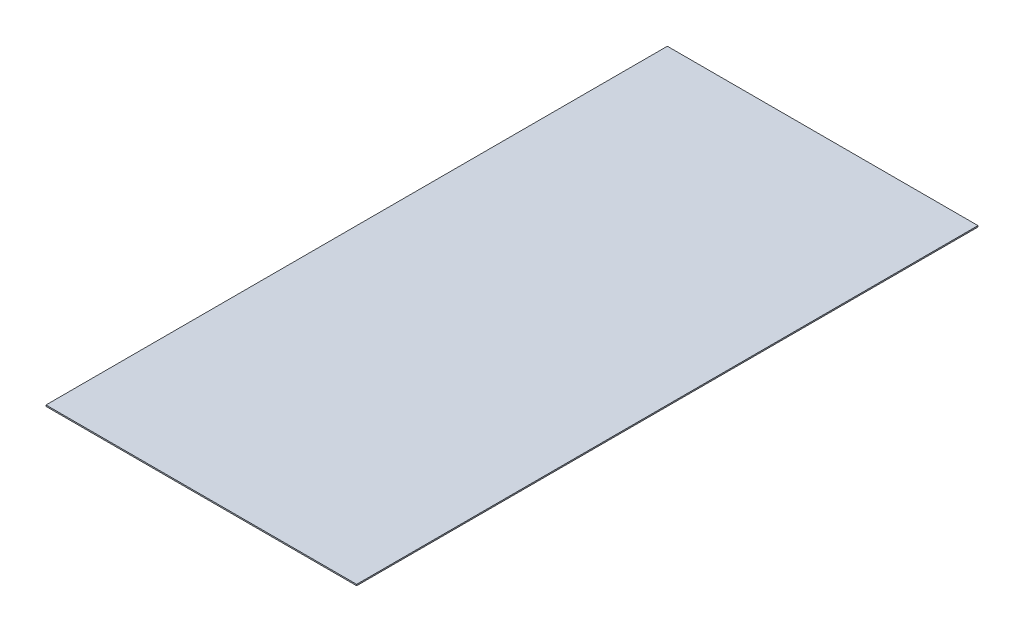
ISO-10303-21;
HEADER;
FILE_DESCRIPTION(('STEP AP214'),'2;1');
FILE_NAME('part.step','',(''),(''),'','','');
FILE_SCHEMA(('AUTOMOTIVE_DESIGN { 1 0 10303 214 1 1 1 1 }'));
ENDSEC;
DATA;
#1=APPLICATION_CONTEXT('core data for automotive mechanical design processes');
#2=APPLICATION_PROTOCOL_DEFINITION('international standard','automotive_design',2000,#1);
#3=PRODUCT_CONTEXT('',#1,'mechanical');
#4=PRODUCT('Part','Part','',(#3));
#5=PRODUCT_RELATED_PRODUCT_CATEGORY('part','',(#4));
#6=PRODUCT_DEFINITION_FORMATION('','',#4);
#7=PRODUCT_DEFINITION_CONTEXT('part definition',#1,'design');
#8=PRODUCT_DEFINITION('design','',#6,#7);
#9=PRODUCT_DEFINITION_SHAPE('','',#8);
#10=(LENGTH_UNIT() NAMED_UNIT(*) SI_UNIT(.MILLI.,.METRE.));
#11=(NAMED_UNIT(*) PLANE_ANGLE_UNIT() SI_UNIT($,.RADIAN.));
#12=(NAMED_UNIT(*) SI_UNIT($,.STERADIAN.) SOLID_ANGLE_UNIT());
#13=UNCERTAINTY_MEASURE_WITH_UNIT(LENGTH_MEASURE(1.E-05),#10,'distance_accuracy_value','');
#14=(GEOMETRIC_REPRESENTATION_CONTEXT(3) GLOBAL_UNCERTAINTY_ASSIGNED_CONTEXT((#13)) GLOBAL_UNIT_ASSIGNED_CONTEXT((#10,
#11,#12)) REPRESENTATION_CONTEXT('',''));
#15=CARTESIAN_POINT('',(0.,0.,0.));
#16=DIRECTION('',(0.,0.,1.));
#17=DIRECTION('',(1.,0.,0.));
#18=AXIS2_PLACEMENT_3D('',#15,#16,#17);
#19=CARTESIAN_POINT('',(610.,5.,1220.));
#20=DIRECTION('',(-1.,0.,0.));
#21=DIRECTION('',(0.,0.,1.));
#22=AXIS2_PLACEMENT_3D('',#19,#20,#21);
#23=PLANE('',#22);
#24=DIRECTION('',(0.,0.,-1.));
#25=VECTOR('',#24,1.);
#26=CARTESIAN_POINT('',(610.,0.,1220.));
#27=LINE('',#26,#25);
#28=CARTESIAN_POINT('',(610.,0.,1220.));
#29=VERTEX_POINT('',#28);
#30=CARTESIAN_POINT('',(610.,0.,-1220.));
#31=VERTEX_POINT('',#30);
#32=EDGE_CURVE('E96',#29,#31,#27,.T.);
#33=ORIENTED_EDGE('',*,*,#32,.T.);
#34=DIRECTION('',(0.,-1.,0.));
#35=VECTOR('',#34,1.);
#36=CARTESIAN_POINT('',(610.,5.,-1220.));
#37=LINE('',#36,#35);
#38=CARTESIAN_POINT('',(610.,5.,-1220.));
#39=VERTEX_POINT('',#38);
#40=EDGE_CURVE('E11',#39,#31,#37,.T.);
#41=ORIENTED_EDGE('',*,*,#40,.F.);
#42=DIRECTION('',(0.,0.,-1.));
#43=VECTOR('',#42,1.);
#44=CARTESIAN_POINT('',(610.,5.,1220.));
#45=LINE('',#44,#43);
#46=CARTESIAN_POINT('',(610.,5.,1220.));
#47=VERTEX_POINT('',#46);
#48=EDGE_CURVE('E84',#47,#39,#45,.T.);
#49=ORIENTED_EDGE('',*,*,#48,.F.);
#50=DIRECTION('',(0.,-1.,0.));
#51=VECTOR('',#50,1.);
#52=CARTESIAN_POINT('',(610.,5.,1220.));
#53=LINE('',#52,#51);
#54=EDGE_CURVE('E92',#47,#29,#53,.T.);
#55=ORIENTED_EDGE('',*,*,#54,.T.);
#56=EDGE_LOOP('',(#33,#41,#49,#55));
#57=FACE_BOUND('',#56,.T.);
#58=ADVANCED_FACE('F33',(#57),#23,.F.);
#59=CARTESIAN_POINT('',(-610.,5.,-1220.));
#60=DIRECTION('',(0.,0.,1.));
#61=DIRECTION('',(1.,0.,0.));
#62=AXIS2_PLACEMENT_3D('',#59,#60,#61);
#63=PLANE('',#62);
#64=DIRECTION('',(-1.,0.,0.));
#65=VECTOR('',#64,1.);
#66=CARTESIAN_POINT('',(-610.,0.,-1220.));
#67=LINE('',#66,#65);
#68=CARTESIAN_POINT('',(-610.,0.,-1220.));
#69=VERTEX_POINT('',#68);
#70=EDGE_CURVE('E88',#31,#69,#67,.T.);
#71=ORIENTED_EDGE('',*,*,#70,.T.);
#72=DIRECTION('',(0.,-1.,0.));
#73=VECTOR('',#72,1.);
#74=CARTESIAN_POINT('',(-610.,5.,-1220.));
#75=LINE('',#74,#73);
#76=CARTESIAN_POINT('',(-610.,5.,-1220.));
#77=VERTEX_POINT('',#76);
#78=EDGE_CURVE('E41',#77,#69,#75,.T.);
#79=ORIENTED_EDGE('',*,*,#78,.F.);
#80=DIRECTION('',(-1.,0.,0.));
#81=VECTOR('',#80,1.);
#82=CARTESIAN_POINT('',(-610.,5.,-1220.));
#83=LINE('',#82,#81);
#84=EDGE_CURVE('E79',#39,#77,#83,.T.);
#85=ORIENTED_EDGE('',*,*,#84,.F.);
#86=ORIENTED_EDGE('',*,*,#40,.T.);
#87=EDGE_LOOP('',(#71,#79,#85,#86));
#88=FACE_BOUND('',#87,.T.);
#89=ADVANCED_FACE('F87',(#88),#63,.F.);
#90=CARTESIAN_POINT('',(-610.,5.,1220.));
#91=DIRECTION('',(1.,0.,0.));
#92=DIRECTION('',(0.,0.,-1.));
#93=AXIS2_PLACEMENT_3D('',#90,#91,#92);
#94=PLANE('',#93);
#95=DIRECTION('',(0.,0.,1.));
#96=VECTOR('',#95,1.);
#97=CARTESIAN_POINT('',(-610.,0.,1220.));
#98=LINE('',#97,#96);
#99=CARTESIAN_POINT('',(-610.,0.,1220.));
#100=VERTEX_POINT('',#99);
#101=EDGE_CURVE('E66',#69,#100,#98,.T.);
#102=ORIENTED_EDGE('',*,*,#101,.T.);
#103=DIRECTION('',(0.,-1.,0.));
#104=VECTOR('',#103,1.);
#105=CARTESIAN_POINT('',(-610.,5.,1220.));
#106=LINE('',#105,#104);
#107=CARTESIAN_POINT('',(-610.,5.,1220.));
#108=VERTEX_POINT('',#107);
#109=EDGE_CURVE('E89',#108,#100,#106,.T.);
#110=ORIENTED_EDGE('',*,*,#109,.F.);
#111=DIRECTION('',(0.,0.,1.));
#112=VECTOR('',#111,1.);
#113=CARTESIAN_POINT('',(-610.,5.,1220.));
#114=LINE('',#113,#112);
#115=EDGE_CURVE('E82',#77,#108,#114,.T.);
#116=ORIENTED_EDGE('',*,*,#115,.F.);
#117=ORIENTED_EDGE('',*,*,#78,.T.);
#118=EDGE_LOOP('',(#102,#110,#116,#117));
#119=FACE_BOUND('',#118,.T.);
#120=ADVANCED_FACE('F90',(#119),#94,.F.);
#121=CARTESIAN_POINT('',(-610.,5.,1220.));
#122=DIRECTION('',(0.,0.,-1.));
#123=DIRECTION('',(-1.,0.,0.));
#124=AXIS2_PLACEMENT_3D('',#121,#122,#123);
#125=PLANE('',#124);
#126=DIRECTION('',(1.,0.,0.));
#127=VECTOR('',#126,1.);
#128=CARTESIAN_POINT('',(-610.,0.,1220.));
#129=LINE('',#128,#127);
#130=EDGE_CURVE('E72',#100,#29,#129,.T.);
#131=ORIENTED_EDGE('',*,*,#130,.T.);
#132=ORIENTED_EDGE('',*,*,#54,.F.);
#133=DIRECTION('',(1.,0.,0.));
#134=VECTOR('',#133,1.);
#135=CARTESIAN_POINT('',(-610.,5.,1220.));
#136=LINE('',#135,#134);
#137=EDGE_CURVE('E49',#108,#47,#136,.T.);
#138=ORIENTED_EDGE('',*,*,#137,.F.);
#139=ORIENTED_EDGE('',*,*,#109,.T.);
#140=EDGE_LOOP('',(#131,#132,#138,#139));
#141=FACE_BOUND('',#140,.T.);
#142=ADVANCED_FACE('F103',(#141),#125,.F.);
#143=CARTESIAN_POINT('',(0.,5.,0.));
#144=DIRECTION('',(0.,-1.,0.));
#145=DIRECTION('',(0.,0.,-1.));
#146=AXIS2_PLACEMENT_3D('',#143,#144,#145);
#147=PLANE('',#146);
#148=ORIENTED_EDGE('',*,*,#48,.T.);
#149=ORIENTED_EDGE('',*,*,#84,.T.);
#150=ORIENTED_EDGE('',*,*,#115,.T.);
#151=ORIENTED_EDGE('',*,*,#137,.T.);
#152=EDGE_LOOP('',(#148,#149,#150,#151));
#153=FACE_BOUND('',#152,.T.);
#154=ADVANCED_FACE('F80',(#153),#147,.F.);
#155=CARTESIAN_POINT('',(0.,0.,0.));
#156=DIRECTION('',(0.,-1.,0.));
#157=DIRECTION('',(0.,0.,-1.));
#158=AXIS2_PLACEMENT_3D('',#155,#156,#157);
#159=PLANE('',#158);
#160=ORIENTED_EDGE('',*,*,#32,.F.);
#161=ORIENTED_EDGE('',*,*,#130,.F.);
#162=ORIENTED_EDGE('',*,*,#101,.F.);
#163=ORIENTED_EDGE('',*,*,#70,.F.);
#164=EDGE_LOOP('',(#160,#161,#162,#163));
#165=FACE_BOUND('',#164,.T.);
#166=ADVANCED_FACE('F106',(#165),#159,.T.);
#167=CLOSED_SHELL('',(#58,#89,#120,#142,#154,#166));
#168=MANIFOLD_SOLID_BREP('B2',#167);
#169=ADVANCED_BREP_SHAPE_REPRESENTATION('',(#18,#168),#14);
#170=SHAPE_DEFINITION_REPRESENTATION(#9,#169);
ENDSEC;
END-ISO-10303-21;
